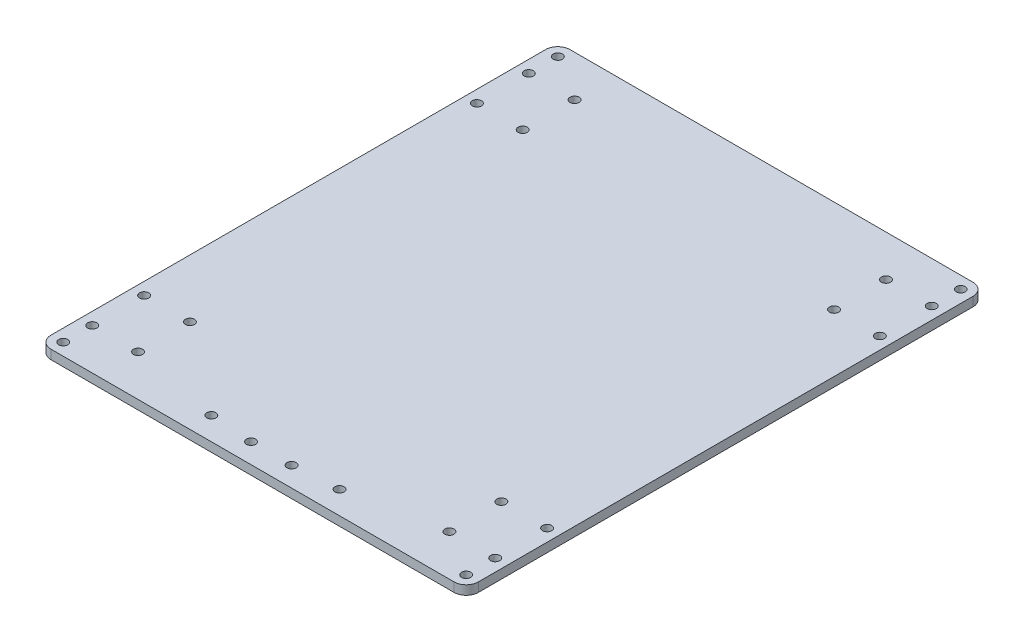
ISO-10303-21;
HEADER;
FILE_DESCRIPTION(('STEP AP214'),'2;1');
FILE_NAME('part.step','',(''),(''),'','','');
FILE_SCHEMA(('AUTOMOTIVE_DESIGN { 1 0 10303 214 1 1 1 1 }'));
ENDSEC;
DATA;
#1=APPLICATION_CONTEXT('core data for automotive mechanical design processes');
#2=APPLICATION_PROTOCOL_DEFINITION('international standard','automotive_design',2000,#1);
#3=PRODUCT_CONTEXT('',#1,'mechanical');
#4=PRODUCT('Part','Part','',(#3));
#5=PRODUCT_RELATED_PRODUCT_CATEGORY('part','',(#4));
#6=PRODUCT_DEFINITION_FORMATION('','',#4);
#7=PRODUCT_DEFINITION_CONTEXT('part definition',#1,'design');
#8=PRODUCT_DEFINITION('design','',#6,#7);
#9=PRODUCT_DEFINITION_SHAPE('','',#8);
#10=(LENGTH_UNIT() NAMED_UNIT(*) SI_UNIT(.MILLI.,.METRE.));
#11=(NAMED_UNIT(*) PLANE_ANGLE_UNIT() SI_UNIT($,.RADIAN.));
#12=(NAMED_UNIT(*) SI_UNIT($,.STERADIAN.) SOLID_ANGLE_UNIT());
#13=UNCERTAINTY_MEASURE_WITH_UNIT(LENGTH_MEASURE(1.E-05),#10,'distance_accuracy_value','');
#14=(GEOMETRIC_REPRESENTATION_CONTEXT(3) GLOBAL_UNCERTAINTY_ASSIGNED_CONTEXT((#13)) GLOBAL_UNIT_ASSIGNED_CONTEXT((#10,
#11,#12)) REPRESENTATION_CONTEXT('',''));
#15=CARTESIAN_POINT('',(0.,0.,0.));
#16=DIRECTION('',(0.,0.,1.));
#17=DIRECTION('',(1.,0.,0.));
#18=AXIS2_PLACEMENT_3D('',#15,#16,#17);
#19=CARTESIAN_POINT('',(-136.,3.,-3.99999999999998));
#20=DIRECTION('',(0.,-1.,0.));
#21=DIRECTION('',(0.,0.,-1.));
#22=AXIS2_PLACEMENT_3D('',#19,#20,#21);
#23=PLANE('',#22);
#24=CARTESIAN_POINT('',(-136.,3.,-3.99999999999998));
#25=DIRECTION('',(0.,1.,0.));
#26=DIRECTION('',(0.,0.,-1.));
#27=AXIS2_PLACEMENT_3D('',#24,#25,#26);
#28=CIRCLE('',#27,4.);
#29=CARTESIAN_POINT('',(-140.,3.,-3.99999999999998));
#30=VERTEX_POINT('',#29);
#31=CARTESIAN_POINT('',(-136.,3.,0.));
#32=VERTEX_POINT('',#31);
#33=EDGE_CURVE('E147',#30,#32,#28,.T.);
#34=ORIENTED_EDGE('',*,*,#33,.T.);
#35=DIRECTION('',(1.,0.,0.));
#36=VECTOR('',#35,1.);
#37=CARTESIAN_POINT('',(-3.99999999999998,3.,0.));
#38=LINE('',#37,#36);
#39=CARTESIAN_POINT('',(-3.99999999999998,3.,0.));
#40=VERTEX_POINT('',#39);
#41=EDGE_CURVE('E95',#32,#40,#38,.T.);
#42=ORIENTED_EDGE('',*,*,#41,.T.);
#43=CARTESIAN_POINT('',(-4.,3.,-4.));
#44=DIRECTION('',(0.,1.,0.));
#45=DIRECTION('',(0.,0.,1.));
#46=AXIS2_PLACEMENT_3D('',#43,#44,#45);
#47=CIRCLE('',#46,4.00000000000001);
#48=CARTESIAN_POINT('',(0.,3.,-4.));
#49=VERTEX_POINT('',#48);
#50=EDGE_CURVE('E162',#40,#49,#47,.T.);
#51=ORIENTED_EDGE('',*,*,#50,.T.);
#52=DIRECTION('',(0.,0.,-1.));
#53=VECTOR('',#52,1.);
#54=CARTESIAN_POINT('',(0.,3.,-166.));
#55=LINE('',#54,#53);
#56=CARTESIAN_POINT('',(0.,3.,-166.));
#57=VERTEX_POINT('',#56);
#58=EDGE_CURVE('E175',#49,#57,#55,.T.);
#59=ORIENTED_EDGE('',*,*,#58,.T.);
#60=CARTESIAN_POINT('',(-4.,3.,-166.));
#61=DIRECTION('',(0.,1.,0.));
#62=DIRECTION('',(0.,0.,-1.));
#63=AXIS2_PLACEMENT_3D('',#60,#61,#62);
#64=CIRCLE('',#63,4.);
#65=CARTESIAN_POINT('',(-4.,3.,-170.));
#66=VERTEX_POINT('',#65);
#67=EDGE_CURVE('E114',#57,#66,#64,.T.);
#68=ORIENTED_EDGE('',*,*,#67,.T.);
#69=DIRECTION('',(-1.,0.,0.));
#70=VECTOR('',#69,1.);
#71=CARTESIAN_POINT('',(-136.,3.,-170.));
#72=LINE('',#71,#70);
#73=CARTESIAN_POINT('',(-136.,3.,-170.));
#74=VERTEX_POINT('',#73);
#75=EDGE_CURVE('E108',#66,#74,#72,.T.);
#76=ORIENTED_EDGE('',*,*,#75,.T.);
#77=CARTESIAN_POINT('',(-136.,3.,-166.));
#78=DIRECTION('',(0.,1.,0.));
#79=DIRECTION('',(0.,0.,-1.));
#80=AXIS2_PLACEMENT_3D('',#77,#78,#79);
#81=CIRCLE('',#80,3.99999999999999);
#82=CARTESIAN_POINT('',(-140.,3.,-166.));
#83=VERTEX_POINT('',#82);
#84=EDGE_CURVE('E112',#74,#83,#81,.T.);
#85=ORIENTED_EDGE('',*,*,#84,.T.);
#86=DIRECTION('',(0.,0.,1.));
#87=VECTOR('',#86,1.);
#88=CARTESIAN_POINT('',(-140.,3.,-3.99999999999998));
#89=LINE('',#88,#87);
#90=EDGE_CURVE('E52',#83,#30,#89,.T.);
#91=ORIENTED_EDGE('',*,*,#90,.T.);
#92=EDGE_LOOP('',(#34,#42,#51,#59,#68,#76,#85,#91));
#93=FACE_BOUND('',#92,.T.);
#94=CARTESIAN_POINT('',(-136.,3.,-166.));
#95=DIRECTION('',(0.,1.,0.));
#96=DIRECTION('',(0.,0.,1.));
#97=AXIS2_PLACEMENT_3D('',#94,#95,#96);
#98=CIRCLE('',#97,1.5);
#99=CARTESIAN_POINT('',(-136.,3.,-164.5));
#100=VERTEX_POINT('',#99);
#101=EDGE_CURVE('E136',#100,#100,#98,.T.);
#102=ORIENTED_EDGE('',*,*,#101,.F.);
#103=EDGE_LOOP('',(#102));
#104=FACE_BOUND('',#103,.T.);
#105=CARTESIAN_POINT('',(-4.,3.,-166.));
#106=DIRECTION('',(0.,1.,0.));
#107=DIRECTION('',(0.,0.,1.));
#108=AXIS2_PLACEMENT_3D('',#105,#106,#107);
#109=CIRCLE('',#108,1.5);
#110=CARTESIAN_POINT('',(-4.,3.,-164.5));
#111=VERTEX_POINT('',#110);
#112=EDGE_CURVE('E184',#111,#111,#109,.T.);
#113=ORIENTED_EDGE('',*,*,#112,.F.);
#114=EDGE_LOOP('',(#113));
#115=FACE_BOUND('',#114,.T.);
#116=CARTESIAN_POINT('',(-136.,3.,-3.99999999999998));
#117=DIRECTION('',(0.,1.,0.));
#118=DIRECTION('',(0.,0.,1.));
#119=AXIS2_PLACEMENT_3D('',#116,#117,#118);
#120=CIRCLE('',#119,1.5);
#121=CARTESIAN_POINT('',(-136.,3.,-2.49999999999999));
#122=VERTEX_POINT('',#121);
#123=EDGE_CURVE('E190',#122,#122,#120,.T.);
#124=ORIENTED_EDGE('',*,*,#123,.F.);
#125=EDGE_LOOP('',(#124));
#126=FACE_BOUND('',#125,.T.);
#127=CARTESIAN_POINT('',(-4.,3.,-4.));
#128=DIRECTION('',(0.,1.,0.));
#129=DIRECTION('',(0.,0.,1.));
#130=AXIS2_PLACEMENT_3D('',#127,#128,#129);
#131=CIRCLE('',#130,1.5);
#132=CARTESIAN_POINT('',(-4.,3.,-2.5));
#133=VERTEX_POINT('',#132);
#134=EDGE_CURVE('E196',#133,#133,#131,.T.);
#135=ORIENTED_EDGE('',*,*,#134,.F.);
#136=EDGE_LOOP('',(#135));
#137=FACE_BOUND('',#136,.T.);
#138=CARTESIAN_POINT('',(-121.,3.,-156.5));
#139=DIRECTION('',(0.,1.,0.));
#140=DIRECTION('',(0.,0.,1.));
#141=AXIS2_PLACEMENT_3D('',#138,#139,#140);
#142=CIRCLE('',#141,1.5);
#143=CARTESIAN_POINT('',(-121.,3.,-155.));
#144=VERTEX_POINT('',#143);
#145=EDGE_CURVE('E202',#144,#144,#142,.T.);
#146=ORIENTED_EDGE('',*,*,#145,.F.);
#147=EDGE_LOOP('',(#146));
#148=FACE_BOUND('',#147,.T.);
#149=CARTESIAN_POINT('',(-136.,3.,-156.5));
#150=DIRECTION('',(0.,1.,0.));
#151=DIRECTION('',(0.,0.,1.));
#152=AXIS2_PLACEMENT_3D('',#149,#150,#151);
#153=CIRCLE('',#152,1.5);
#154=CARTESIAN_POINT('',(-136.,3.,-155.));
#155=VERTEX_POINT('',#154);
#156=EDGE_CURVE('E208',#155,#155,#153,.T.);
#157=ORIENTED_EDGE('',*,*,#156,.F.);
#158=EDGE_LOOP('',(#157));
#159=FACE_BOUND('',#158,.T.);
#160=CARTESIAN_POINT('',(-136.,3.,-139.5));
#161=DIRECTION('',(0.,1.,0.));
#162=DIRECTION('',(0.,0.,1.));
#163=AXIS2_PLACEMENT_3D('',#160,#161,#162);
#164=CIRCLE('',#163,1.5);
#165=CARTESIAN_POINT('',(-136.,3.,-138.));
#166=VERTEX_POINT('',#165);
#167=EDGE_CURVE('E214',#166,#166,#164,.T.);
#168=ORIENTED_EDGE('',*,*,#167,.F.);
#169=EDGE_LOOP('',(#168));
#170=FACE_BOUND('',#169,.T.);
#171=CARTESIAN_POINT('',(-121.,3.,-139.5));
#172=DIRECTION('',(0.,1.,0.));
#173=DIRECTION('',(0.,0.,1.));
#174=AXIS2_PLACEMENT_3D('',#171,#172,#173);
#175=CIRCLE('',#174,1.5);
#176=CARTESIAN_POINT('',(-121.,3.,-138.));
#177=VERTEX_POINT('',#176);
#178=EDGE_CURVE('E220',#177,#177,#175,.T.);
#179=ORIENTED_EDGE('',*,*,#178,.F.);
#180=EDGE_LOOP('',(#179));
#181=FACE_BOUND('',#180,.T.);
#182=CARTESIAN_POINT('',(-19.,3.,-156.5));
#183=DIRECTION('',(0.,1.,0.));
#184=DIRECTION('',(0.,0.,1.));
#185=AXIS2_PLACEMENT_3D('',#182,#183,#184);
#186=CIRCLE('',#185,1.49999999999999);
#187=CARTESIAN_POINT('',(-19.,3.,-155.));
#188=VERTEX_POINT('',#187);
#189=EDGE_CURVE('E226',#188,#188,#186,.T.);
#190=ORIENTED_EDGE('',*,*,#189,.F.);
#191=EDGE_LOOP('',(#190));
#192=FACE_BOUND('',#191,.T.);
#193=CARTESIAN_POINT('',(-3.99999999999998,3.,-156.5));
#194=DIRECTION('',(0.,1.,0.));
#195=DIRECTION('',(0.,0.,1.));
#196=AXIS2_PLACEMENT_3D('',#193,#194,#195);
#197=CIRCLE('',#196,1.5);
#198=CARTESIAN_POINT('',(-3.99999999999998,3.,-155.));
#199=VERTEX_POINT('',#198);
#200=EDGE_CURVE('E232',#199,#199,#197,.T.);
#201=ORIENTED_EDGE('',*,*,#200,.F.);
#202=EDGE_LOOP('',(#201));
#203=FACE_BOUND('',#202,.T.);
#204=CARTESIAN_POINT('',(-3.99999999999999,3.,-139.5));
#205=DIRECTION('',(0.,1.,0.));
#206=DIRECTION('',(0.,0.,1.));
#207=AXIS2_PLACEMENT_3D('',#204,#205,#206);
#208=CIRCLE('',#207,1.5);
#209=CARTESIAN_POINT('',(-3.99999999999999,3.,-138.));
#210=VERTEX_POINT('',#209);
#211=EDGE_CURVE('E238',#210,#210,#208,.T.);
#212=ORIENTED_EDGE('',*,*,#211,.F.);
#213=EDGE_LOOP('',(#212));
#214=FACE_BOUND('',#213,.T.);
#215=CARTESIAN_POINT('',(-19.,3.,-139.5));
#216=DIRECTION('',(0.,1.,0.));
#217=DIRECTION('',(0.,0.,1.));
#218=AXIS2_PLACEMENT_3D('',#215,#216,#217);
#219=CIRCLE('',#218,1.50000000000002);
#220=CARTESIAN_POINT('',(-19.,3.,-138.));
#221=VERTEX_POINT('',#220);
#222=EDGE_CURVE('E244',#221,#221,#219,.T.);
#223=ORIENTED_EDGE('',*,*,#222,.F.);
#224=EDGE_LOOP('',(#223));
#225=FACE_BOUND('',#224,.T.);
#226=CARTESIAN_POINT('',(-63.6906513248161,3.,-6.49999999999999));
#227=DIRECTION('',(0.,1.,0.));
#228=DIRECTION('',(0.,0.,1.));
#229=AXIS2_PLACEMENT_3D('',#226,#227,#228);
#230=CIRCLE('',#229,1.5);
#231=CARTESIAN_POINT('',(-63.6906513248161,3.,-4.99999999999999));
#232=VERTEX_POINT('',#231);
#233=EDGE_CURVE('E250',#232,#232,#230,.T.);
#234=ORIENTED_EDGE('',*,*,#233,.F.);
#235=EDGE_LOOP('',(#234));
#236=FACE_BOUND('',#235,.T.);
#237=CARTESIAN_POINT('',(-77.,3.,-6.49999999999999));
#238=DIRECTION('',(0.,1.,0.));
#239=DIRECTION('',(0.,0.,1.));
#240=AXIS2_PLACEMENT_3D('',#237,#238,#239);
#241=CIRCLE('',#240,1.5);
#242=CARTESIAN_POINT('',(-77.,3.,-4.99999999999999));
#243=VERTEX_POINT('',#242);
#244=EDGE_CURVE('E256',#243,#243,#241,.T.);
#245=ORIENTED_EDGE('',*,*,#244,.F.);
#246=EDGE_LOOP('',(#245));
#247=FACE_BOUND('',#246,.T.);
#248=CARTESIAN_POINT('',(-121.,3.,-30.5));
#249=DIRECTION('',(0.,1.,0.));
#250=DIRECTION('',(0.,0.,1.));
#251=AXIS2_PLACEMENT_3D('',#248,#249,#250);
#252=CIRCLE('',#251,1.5);
#253=CARTESIAN_POINT('',(-121.,3.,-29.));
#254=VERTEX_POINT('',#253);
#255=EDGE_CURVE('E262',#254,#254,#252,.T.);
#256=ORIENTED_EDGE('',*,*,#255,.F.);
#257=EDGE_LOOP('',(#256));
#258=FACE_BOUND('',#257,.T.);
#259=CARTESIAN_POINT('',(-136.,3.,-30.5));
#260=DIRECTION('',(0.,1.,0.));
#261=DIRECTION('',(0.,0.,1.));
#262=AXIS2_PLACEMENT_3D('',#259,#260,#261);
#263=CIRCLE('',#262,1.5);
#264=CARTESIAN_POINT('',(-136.,3.,-29.));
#265=VERTEX_POINT('',#264);
#266=EDGE_CURVE('E268',#265,#265,#263,.T.);
#267=ORIENTED_EDGE('',*,*,#266,.F.);
#268=EDGE_LOOP('',(#267));
#269=FACE_BOUND('',#268,.T.);
#270=CARTESIAN_POINT('',(-136.,3.,-13.5));
#271=DIRECTION('',(0.,1.,0.));
#272=DIRECTION('',(0.,0.,1.));
#273=AXIS2_PLACEMENT_3D('',#270,#271,#272);
#274=CIRCLE('',#273,1.5);
#275=CARTESIAN_POINT('',(-136.,3.,-12.));
#276=VERTEX_POINT('',#275);
#277=EDGE_CURVE('E274',#276,#276,#274,.T.);
#278=ORIENTED_EDGE('',*,*,#277,.F.);
#279=EDGE_LOOP('',(#278));
#280=FACE_BOUND('',#279,.T.);
#281=CARTESIAN_POINT('',(-121.,3.,-13.5));
#282=DIRECTION('',(0.,1.,0.));
#283=DIRECTION('',(0.,0.,1.));
#284=AXIS2_PLACEMENT_3D('',#281,#282,#283);
#285=CIRCLE('',#284,1.5);
#286=CARTESIAN_POINT('',(-121.,3.,-12.));
#287=VERTEX_POINT('',#286);
#288=EDGE_CURVE('E280',#287,#287,#285,.T.);
#289=ORIENTED_EDGE('',*,*,#288,.F.);
#290=EDGE_LOOP('',(#289));
#291=FACE_BOUND('',#290,.T.);
#292=CARTESIAN_POINT('',(-18.9999999999996,3.,-30.5000000000001));
#293=DIRECTION('',(0.,1.,0.));
#294=DIRECTION('',(0.,0.,1.));
#295=AXIS2_PLACEMENT_3D('',#292,#293,#294);
#296=CIRCLE('',#295,1.5);
#297=CARTESIAN_POINT('',(-18.9999999999996,3.,-29.0000000000001));
#298=VERTEX_POINT('',#297);
#299=EDGE_CURVE('E286',#298,#298,#296,.T.);
#300=ORIENTED_EDGE('',*,*,#299,.F.);
#301=EDGE_LOOP('',(#300));
#302=FACE_BOUND('',#301,.T.);
#303=CARTESIAN_POINT('',(-3.99999999999955,3.,-30.5000000000002));
#304=DIRECTION('',(0.,1.,0.));
#305=DIRECTION('',(0.,0.,1.));
#306=AXIS2_PLACEMENT_3D('',#303,#304,#305);
#307=CIRCLE('',#306,1.5);
#308=CARTESIAN_POINT('',(-3.99999999999955,3.,-29.0000000000002));
#309=VERTEX_POINT('',#308);
#310=EDGE_CURVE('E292',#309,#309,#307,.T.);
#311=ORIENTED_EDGE('',*,*,#310,.F.);
#312=EDGE_LOOP('',(#311));
#313=FACE_BOUND('',#312,.T.);
#314=CARTESIAN_POINT('',(-18.9999999999994,3.,-13.5000000000001));
#315=DIRECTION('',(0.,1.,0.));
#316=DIRECTION('',(0.,0.,1.));
#317=AXIS2_PLACEMENT_3D('',#314,#315,#316);
#318=CIRCLE('',#317,1.50000000000001);
#319=CARTESIAN_POINT('',(-18.9999999999994,3.,-12.0000000000001));
#320=VERTEX_POINT('',#319);
#321=EDGE_CURVE('E298',#320,#320,#318,.T.);
#322=ORIENTED_EDGE('',*,*,#321,.F.);
#323=EDGE_LOOP('',(#322));
#324=FACE_BOUND('',#323,.T.);
#325=CARTESIAN_POINT('',(-3.99999999999945,3.,-13.5000000000002));
#326=DIRECTION('',(0.,1.,0.));
#327=DIRECTION('',(0.,0.,1.));
#328=AXIS2_PLACEMENT_3D('',#325,#326,#327);
#329=CIRCLE('',#328,1.50000000000001);
#330=CARTESIAN_POINT('',(-3.99999999999945,3.,-12.0000000000002));
#331=VERTEX_POINT('',#330);
#332=EDGE_CURVE('E304',#331,#331,#329,.T.);
#333=ORIENTED_EDGE('',*,*,#332,.F.);
#334=EDGE_LOOP('',(#333));
#335=FACE_BOUND('',#334,.T.);
#336=CARTESIAN_POINT('',(-91.0000000000013,3.,-7.50000000000098));
#337=DIRECTION('',(0.,1.,0.));
#338=DIRECTION('',(0.,0.,1.));
#339=AXIS2_PLACEMENT_3D('',#336,#337,#338);
#340=CIRCLE('',#339,1.5);
#341=CARTESIAN_POINT('',(-91.0000000000013,3.,-6.00000000000098));
#342=VERTEX_POINT('',#341);
#343=EDGE_CURVE('E310',#342,#342,#340,.T.);
#344=ORIENTED_EDGE('',*,*,#343,.F.);
#345=EDGE_LOOP('',(#344));
#346=FACE_BOUND('',#345,.T.);
#347=CARTESIAN_POINT('',(-49.0000000000013,3.,-7.50000000000038));
#348=DIRECTION('',(0.,1.,0.));
#349=DIRECTION('',(0.,0.,1.));
#350=AXIS2_PLACEMENT_3D('',#347,#348,#349);
#351=CIRCLE('',#350,1.5);
#352=CARTESIAN_POINT('',(-49.0000000000013,3.,-6.00000000000039));
#353=VERTEX_POINT('',#352);
#354=EDGE_CURVE('E316',#353,#353,#351,.T.);
#355=ORIENTED_EDGE('',*,*,#354,.F.);
#356=EDGE_LOOP('',(#355));
#357=FACE_BOUND('',#356,.T.);
#358=ADVANCED_FACE('F35',(#93,#104,#115,#126,#137,#148,#159,#170,#181,#192,#203,#214,#225,#236,
#247,#258,#269,#280,#291,#302,#313,#324,#335,#346,#357),#23,.F.);
#359=CARTESIAN_POINT('',(-136.,0.,-3.99999999999998));
#360=DIRECTION('',(0.,-1.,0.));
#361=DIRECTION('',(0.,0.,-1.));
#362=AXIS2_PLACEMENT_3D('',#359,#360,#361);
#363=PLANE('',#362);
#364=CARTESIAN_POINT('',(-91.0000000000013,0.,-7.50000000000098));
#365=DIRECTION('',(0.,1.,0.));
#366=DIRECTION('',(0.,0.,1.));
#367=AXIS2_PLACEMENT_3D('',#364,#365,#366);
#368=CIRCLE('',#367,1.5);
#369=CARTESIAN_POINT('',(-91.0000000000013,0.,-6.00000000000098));
#370=VERTEX_POINT('',#369);
#371=EDGE_CURVE('E313',#370,#370,#368,.T.);
#372=ORIENTED_EDGE('',*,*,#371,.T.);
#373=EDGE_LOOP('',(#372));
#374=FACE_BOUND('',#373,.T.);
#375=CARTESIAN_POINT('',(-18.9999999999994,0.,-13.5000000000001));
#376=DIRECTION('',(0.,1.,0.));
#377=DIRECTION('',(0.,0.,1.));
#378=AXIS2_PLACEMENT_3D('',#375,#376,#377);
#379=CIRCLE('',#378,1.50000000000001);
#380=CARTESIAN_POINT('',(-18.9999999999994,0.,-12.0000000000001));
#381=VERTEX_POINT('',#380);
#382=EDGE_CURVE('E301',#381,#381,#379,.T.);
#383=ORIENTED_EDGE('',*,*,#382,.T.);
#384=EDGE_LOOP('',(#383));
#385=FACE_BOUND('',#384,.T.);
#386=CARTESIAN_POINT('',(-18.9999999999996,0.,-30.5000000000001));
#387=DIRECTION('',(0.,1.,0.));
#388=DIRECTION('',(0.,0.,1.));
#389=AXIS2_PLACEMENT_3D('',#386,#387,#388);
#390=CIRCLE('',#389,1.5);
#391=CARTESIAN_POINT('',(-18.9999999999996,0.,-29.0000000000001));
#392=VERTEX_POINT('',#391);
#393=EDGE_CURVE('E289',#392,#392,#390,.T.);
#394=ORIENTED_EDGE('',*,*,#393,.T.);
#395=EDGE_LOOP('',(#394));
#396=FACE_BOUND('',#395,.T.);
#397=CARTESIAN_POINT('',(-136.,0.,-13.5));
#398=DIRECTION('',(0.,1.,0.));
#399=DIRECTION('',(0.,0.,1.));
#400=AXIS2_PLACEMENT_3D('',#397,#398,#399);
#401=CIRCLE('',#400,1.5);
#402=CARTESIAN_POINT('',(-136.,0.,-12.));
#403=VERTEX_POINT('',#402);
#404=EDGE_CURVE('E277',#403,#403,#401,.T.);
#405=ORIENTED_EDGE('',*,*,#404,.T.);
#406=EDGE_LOOP('',(#405));
#407=FACE_BOUND('',#406,.T.);
#408=CARTESIAN_POINT('',(-121.,0.,-30.5));
#409=DIRECTION('',(0.,1.,0.));
#410=DIRECTION('',(0.,0.,1.));
#411=AXIS2_PLACEMENT_3D('',#408,#409,#410);
#412=CIRCLE('',#411,1.5);
#413=CARTESIAN_POINT('',(-121.,0.,-29.));
#414=VERTEX_POINT('',#413);
#415=EDGE_CURVE('E265',#414,#414,#412,.T.);
#416=ORIENTED_EDGE('',*,*,#415,.T.);
#417=EDGE_LOOP('',(#416));
#418=FACE_BOUND('',#417,.T.);
#419=CARTESIAN_POINT('',(-63.6906513248161,0.,-6.49999999999999));
#420=DIRECTION('',(0.,1.,0.));
#421=DIRECTION('',(0.,0.,1.));
#422=AXIS2_PLACEMENT_3D('',#419,#420,#421);
#423=CIRCLE('',#422,1.5);
#424=CARTESIAN_POINT('',(-63.6906513248161,0.,-4.99999999999999));
#425=VERTEX_POINT('',#424);
#426=EDGE_CURVE('E253',#425,#425,#423,.T.);
#427=ORIENTED_EDGE('',*,*,#426,.T.);
#428=EDGE_LOOP('',(#427));
#429=FACE_BOUND('',#428,.T.);
#430=CARTESIAN_POINT('',(-3.99999999999999,0.,-139.5));
#431=DIRECTION('',(0.,1.,0.));
#432=DIRECTION('',(0.,0.,1.));
#433=AXIS2_PLACEMENT_3D('',#430,#431,#432);
#434=CIRCLE('',#433,1.5);
#435=CARTESIAN_POINT('',(-3.99999999999999,0.,-138.));
#436=VERTEX_POINT('',#435);
#437=EDGE_CURVE('E241',#436,#436,#434,.T.);
#438=ORIENTED_EDGE('',*,*,#437,.T.);
#439=EDGE_LOOP('',(#438));
#440=FACE_BOUND('',#439,.T.);
#441=CARTESIAN_POINT('',(-19.,0.,-156.5));
#442=DIRECTION('',(0.,1.,0.));
#443=DIRECTION('',(0.,0.,1.));
#444=AXIS2_PLACEMENT_3D('',#441,#442,#443);
#445=CIRCLE('',#444,1.49999999999999);
#446=CARTESIAN_POINT('',(-19.,0.,-155.));
#447=VERTEX_POINT('',#446);
#448=EDGE_CURVE('E229',#447,#447,#445,.T.);
#449=ORIENTED_EDGE('',*,*,#448,.T.);
#450=EDGE_LOOP('',(#449));
#451=FACE_BOUND('',#450,.T.);
#452=CARTESIAN_POINT('',(-136.,0.,-139.5));
#453=DIRECTION('',(0.,1.,0.));
#454=DIRECTION('',(0.,0.,1.));
#455=AXIS2_PLACEMENT_3D('',#452,#453,#454);
#456=CIRCLE('',#455,1.5);
#457=CARTESIAN_POINT('',(-136.,0.,-138.));
#458=VERTEX_POINT('',#457);
#459=EDGE_CURVE('E217',#458,#458,#456,.T.);
#460=ORIENTED_EDGE('',*,*,#459,.T.);
#461=EDGE_LOOP('',(#460));
#462=FACE_BOUND('',#461,.T.);
#463=CARTESIAN_POINT('',(-121.,0.,-156.5));
#464=DIRECTION('',(0.,1.,0.));
#465=DIRECTION('',(0.,0.,1.));
#466=AXIS2_PLACEMENT_3D('',#463,#464,#465);
#467=CIRCLE('',#466,1.5);
#468=CARTESIAN_POINT('',(-121.,0.,-155.));
#469=VERTEX_POINT('',#468);
#470=EDGE_CURVE('E205',#469,#469,#467,.T.);
#471=ORIENTED_EDGE('',*,*,#470,.T.);
#472=EDGE_LOOP('',(#471));
#473=FACE_BOUND('',#472,.T.);
#474=CARTESIAN_POINT('',(-136.,0.,-3.99999999999998));
#475=DIRECTION('',(0.,1.,0.));
#476=DIRECTION('',(0.,0.,1.));
#477=AXIS2_PLACEMENT_3D('',#474,#475,#476);
#478=CIRCLE('',#477,1.5);
#479=CARTESIAN_POINT('',(-136.,0.,-2.49999999999999));
#480=VERTEX_POINT('',#479);
#481=EDGE_CURVE('E193',#480,#480,#478,.T.);
#482=ORIENTED_EDGE('',*,*,#481,.T.);
#483=EDGE_LOOP('',(#482));
#484=FACE_BOUND('',#483,.T.);
#485=CARTESIAN_POINT('',(-136.,0.,-166.));
#486=DIRECTION('',(0.,1.,0.));
#487=DIRECTION('',(0.,0.,1.));
#488=AXIS2_PLACEMENT_3D('',#485,#486,#487);
#489=CIRCLE('',#488,1.5);
#490=CARTESIAN_POINT('',(-136.,0.,-164.5));
#491=VERTEX_POINT('',#490);
#492=EDGE_CURVE('E181',#491,#491,#489,.T.);
#493=ORIENTED_EDGE('',*,*,#492,.T.);
#494=EDGE_LOOP('',(#493));
#495=FACE_BOUND('',#494,.T.);
#496=CARTESIAN_POINT('',(-136.,0.,-3.99999999999998));
#497=DIRECTION('',(0.,1.,0.));
#498=DIRECTION('',(0.,0.,-1.));
#499=AXIS2_PLACEMENT_3D('',#496,#497,#498);
#500=CIRCLE('',#499,4.);
#501=CARTESIAN_POINT('',(-140.,0.,-3.99999999999998));
#502=VERTEX_POINT('',#501);
#503=CARTESIAN_POINT('',(-136.,0.,0.));
#504=VERTEX_POINT('',#503);
#505=EDGE_CURVE('E132',#502,#504,#500,.T.);
#506=ORIENTED_EDGE('',*,*,#505,.F.);
#507=DIRECTION('',(0.,0.,1.));
#508=VECTOR('',#507,1.);
#509=CARTESIAN_POINT('',(-140.,0.,-3.99999999999998));
#510=LINE('',#509,#508);
#511=CARTESIAN_POINT('',(-140.,0.,-166.));
#512=VERTEX_POINT('',#511);
#513=EDGE_CURVE('E87',#512,#502,#510,.T.);
#514=ORIENTED_EDGE('',*,*,#513,.F.);
#515=CARTESIAN_POINT('',(-136.,0.,-166.));
#516=DIRECTION('',(0.,1.,0.));
#517=DIRECTION('',(0.,0.,-1.));
#518=AXIS2_PLACEMENT_3D('',#515,#516,#517);
#519=CIRCLE('',#518,3.99999999999999);
#520=CARTESIAN_POINT('',(-136.,0.,-170.));
#521=VERTEX_POINT('',#520);
#522=EDGE_CURVE('E81',#521,#512,#519,.T.);
#523=ORIENTED_EDGE('',*,*,#522,.F.);
#524=DIRECTION('',(-1.,0.,0.));
#525=VECTOR('',#524,1.);
#526=CARTESIAN_POINT('',(-136.,0.,-170.));
#527=LINE('',#526,#525);
#528=CARTESIAN_POINT('',(-4.,0.,-170.));
#529=VERTEX_POINT('',#528);
#530=EDGE_CURVE('E122',#529,#521,#527,.T.);
#531=ORIENTED_EDGE('',*,*,#530,.F.);
#532=CARTESIAN_POINT('',(-4.,0.,-166.));
#533=DIRECTION('',(0.,1.,0.));
#534=DIRECTION('',(0.,0.,-1.));
#535=AXIS2_PLACEMENT_3D('',#532,#533,#534);
#536=CIRCLE('',#535,4.);
#537=CARTESIAN_POINT('',(0.,0.,-166.));
#538=VERTEX_POINT('',#537);
#539=EDGE_CURVE('E142',#538,#529,#536,.T.);
#540=ORIENTED_EDGE('',*,*,#539,.F.);
#541=DIRECTION('',(0.,0.,-1.));
#542=VECTOR('',#541,1.);
#543=CARTESIAN_POINT('',(0.,0.,-166.));
#544=LINE('',#543,#542);
#545=CARTESIAN_POINT('',(0.,0.,-4.));
#546=VERTEX_POINT('',#545);
#547=EDGE_CURVE('E140',#546,#538,#544,.T.);
#548=ORIENTED_EDGE('',*,*,#547,.F.);
#549=CARTESIAN_POINT('',(-4.,0.,-4.));
#550=DIRECTION('',(0.,1.,0.));
#551=DIRECTION('',(0.,0.,1.));
#552=AXIS2_PLACEMENT_3D('',#549,#550,#551);
#553=CIRCLE('',#552,4.00000000000001);
#554=CARTESIAN_POINT('',(-3.99999999999998,0.,0.));
#555=VERTEX_POINT('',#554);
#556=EDGE_CURVE('E138',#555,#546,#553,.T.);
#557=ORIENTED_EDGE('',*,*,#556,.F.);
#558=DIRECTION('',(1.,0.,0.));
#559=VECTOR('',#558,1.);
#560=CARTESIAN_POINT('',(-3.99999999999998,0.,0.));
#561=LINE('',#560,#559);
#562=EDGE_CURVE('E135',#504,#555,#561,.T.);
#563=ORIENTED_EDGE('',*,*,#562,.F.);
#564=EDGE_LOOP('',(#506,#514,#523,#531,#540,#548,#557,#563));
#565=FACE_BOUND('',#564,.T.);
#566=CARTESIAN_POINT('',(-4.,0.,-166.));
#567=DIRECTION('',(0.,1.,0.));
#568=DIRECTION('',(0.,0.,1.));
#569=AXIS2_PLACEMENT_3D('',#566,#567,#568);
#570=CIRCLE('',#569,1.5);
#571=CARTESIAN_POINT('',(-4.,0.,-164.5));
#572=VERTEX_POINT('',#571);
#573=EDGE_CURVE('E187',#572,#572,#570,.T.);
#574=ORIENTED_EDGE('',*,*,#573,.T.);
#575=EDGE_LOOP('',(#574));
#576=FACE_BOUND('',#575,.T.);
#577=CARTESIAN_POINT('',(-4.,0.,-4.));
#578=DIRECTION('',(0.,1.,0.));
#579=DIRECTION('',(0.,0.,1.));
#580=AXIS2_PLACEMENT_3D('',#577,#578,#579);
#581=CIRCLE('',#580,1.5);
#582=CARTESIAN_POINT('',(-4.,0.,-2.5));
#583=VERTEX_POINT('',#582);
#584=EDGE_CURVE('E199',#583,#583,#581,.T.);
#585=ORIENTED_EDGE('',*,*,#584,.T.);
#586=EDGE_LOOP('',(#585));
#587=FACE_BOUND('',#586,.T.);
#588=CARTESIAN_POINT('',(-136.,0.,-156.5));
#589=DIRECTION('',(0.,1.,0.));
#590=DIRECTION('',(0.,0.,1.));
#591=AXIS2_PLACEMENT_3D('',#588,#589,#590);
#592=CIRCLE('',#591,1.5);
#593=CARTESIAN_POINT('',(-136.,0.,-155.));
#594=VERTEX_POINT('',#593);
#595=EDGE_CURVE('E211',#594,#594,#592,.T.);
#596=ORIENTED_EDGE('',*,*,#595,.T.);
#597=EDGE_LOOP('',(#596));
#598=FACE_BOUND('',#597,.T.);
#599=CARTESIAN_POINT('',(-121.,0.,-139.5));
#600=DIRECTION('',(0.,1.,0.));
#601=DIRECTION('',(0.,0.,1.));
#602=AXIS2_PLACEMENT_3D('',#599,#600,#601);
#603=CIRCLE('',#602,1.5);
#604=CARTESIAN_POINT('',(-121.,0.,-138.));
#605=VERTEX_POINT('',#604);
#606=EDGE_CURVE('E223',#605,#605,#603,.T.);
#607=ORIENTED_EDGE('',*,*,#606,.T.);
#608=EDGE_LOOP('',(#607));
#609=FACE_BOUND('',#608,.T.);
#610=CARTESIAN_POINT('',(-3.99999999999998,0.,-156.5));
#611=DIRECTION('',(0.,1.,0.));
#612=DIRECTION('',(0.,0.,1.));
#613=AXIS2_PLACEMENT_3D('',#610,#611,#612);
#614=CIRCLE('',#613,1.5);
#615=CARTESIAN_POINT('',(-3.99999999999998,0.,-155.));
#616=VERTEX_POINT('',#615);
#617=EDGE_CURVE('E235',#616,#616,#614,.T.);
#618=ORIENTED_EDGE('',*,*,#617,.T.);
#619=EDGE_LOOP('',(#618));
#620=FACE_BOUND('',#619,.T.);
#621=CARTESIAN_POINT('',(-19.,0.,-139.5));
#622=DIRECTION('',(0.,1.,0.));
#623=DIRECTION('',(0.,0.,1.));
#624=AXIS2_PLACEMENT_3D('',#621,#622,#623);
#625=CIRCLE('',#624,1.50000000000002);
#626=CARTESIAN_POINT('',(-19.,0.,-138.));
#627=VERTEX_POINT('',#626);
#628=EDGE_CURVE('E247',#627,#627,#625,.T.);
#629=ORIENTED_EDGE('',*,*,#628,.T.);
#630=EDGE_LOOP('',(#629));
#631=FACE_BOUND('',#630,.T.);
#632=CARTESIAN_POINT('',(-77.,0.,-6.49999999999999));
#633=DIRECTION('',(0.,1.,0.));
#634=DIRECTION('',(0.,0.,1.));
#635=AXIS2_PLACEMENT_3D('',#632,#633,#634);
#636=CIRCLE('',#635,1.5);
#637=CARTESIAN_POINT('',(-77.,0.,-4.99999999999999));
#638=VERTEX_POINT('',#637);
#639=EDGE_CURVE('E259',#638,#638,#636,.T.);
#640=ORIENTED_EDGE('',*,*,#639,.T.);
#641=EDGE_LOOP('',(#640));
#642=FACE_BOUND('',#641,.T.);
#643=CARTESIAN_POINT('',(-136.,0.,-30.5));
#644=DIRECTION('',(0.,1.,0.));
#645=DIRECTION('',(0.,0.,1.));
#646=AXIS2_PLACEMENT_3D('',#643,#644,#645);
#647=CIRCLE('',#646,1.5);
#648=CARTESIAN_POINT('',(-136.,0.,-29.));
#649=VERTEX_POINT('',#648);
#650=EDGE_CURVE('E271',#649,#649,#647,.T.);
#651=ORIENTED_EDGE('',*,*,#650,.T.);
#652=EDGE_LOOP('',(#651));
#653=FACE_BOUND('',#652,.T.);
#654=CARTESIAN_POINT('',(-121.,0.,-13.5));
#655=DIRECTION('',(0.,1.,0.));
#656=DIRECTION('',(0.,0.,1.));
#657=AXIS2_PLACEMENT_3D('',#654,#655,#656);
#658=CIRCLE('',#657,1.5);
#659=CARTESIAN_POINT('',(-121.,0.,-12.));
#660=VERTEX_POINT('',#659);
#661=EDGE_CURVE('E283',#660,#660,#658,.T.);
#662=ORIENTED_EDGE('',*,*,#661,.T.);
#663=EDGE_LOOP('',(#662));
#664=FACE_BOUND('',#663,.T.);
#665=CARTESIAN_POINT('',(-3.99999999999955,0.,-30.5000000000002));
#666=DIRECTION('',(0.,1.,0.));
#667=DIRECTION('',(0.,0.,1.));
#668=AXIS2_PLACEMENT_3D('',#665,#666,#667);
#669=CIRCLE('',#668,1.5);
#670=CARTESIAN_POINT('',(-3.99999999999955,0.,-29.0000000000002));
#671=VERTEX_POINT('',#670);
#672=EDGE_CURVE('E295',#671,#671,#669,.T.);
#673=ORIENTED_EDGE('',*,*,#672,.T.);
#674=EDGE_LOOP('',(#673));
#675=FACE_BOUND('',#674,.T.);
#676=CARTESIAN_POINT('',(-3.99999999999945,0.,-13.5000000000002));
#677=DIRECTION('',(0.,1.,0.));
#678=DIRECTION('',(0.,0.,1.));
#679=AXIS2_PLACEMENT_3D('',#676,#677,#678);
#680=CIRCLE('',#679,1.50000000000001);
#681=CARTESIAN_POINT('',(-3.99999999999945,0.,-12.0000000000002));
#682=VERTEX_POINT('',#681);
#683=EDGE_CURVE('E307',#682,#682,#680,.T.);
#684=ORIENTED_EDGE('',*,*,#683,.T.);
#685=EDGE_LOOP('',(#684));
#686=FACE_BOUND('',#685,.T.);
#687=CARTESIAN_POINT('',(-49.0000000000013,0.,-7.50000000000038));
#688=DIRECTION('',(0.,1.,0.));
#689=DIRECTION('',(0.,0.,1.));
#690=AXIS2_PLACEMENT_3D('',#687,#688,#689);
#691=CIRCLE('',#690,1.5);
#692=CARTESIAN_POINT('',(-49.0000000000013,0.,-6.00000000000039));
#693=VERTEX_POINT('',#692);
#694=EDGE_CURVE('E319',#693,#693,#691,.T.);
#695=ORIENTED_EDGE('',*,*,#694,.T.);
#696=EDGE_LOOP('',(#695));
#697=FACE_BOUND('',#696,.T.);
#698=ADVANCED_FACE('F166',(#374,#385,#396,#407,#418,#429,#440,#451,#462,#473,#484,#495,#565,
#576,#587,#598,#609,#620,#631,#642,#653,#664,#675,#686,#697),#363,.T.);
#699=CARTESIAN_POINT('',(-136.,3.,-3.99999999999998));
#700=DIRECTION('',(0.,-1.,0.));
#701=DIRECTION('',(0.,0.,-1.));
#702=AXIS2_PLACEMENT_3D('',#699,#700,#701);
#703=CYLINDRICAL_SURFACE('',#702,4.);
#704=ORIENTED_EDGE('',*,*,#505,.T.);
#705=DIRECTION('',(0.,-1.,0.));
#706=VECTOR('',#705,1.);
#707=CARTESIAN_POINT('',(-136.,3.,0.));
#708=LINE('',#707,#706);
#709=EDGE_CURVE('E11',#32,#504,#708,.T.);
#710=ORIENTED_EDGE('',*,*,#709,.F.);
#711=ORIENTED_EDGE('',*,*,#33,.F.);
#712=DIRECTION('',(0.,-1.,0.));
#713=VECTOR('',#712,1.);
#714=CARTESIAN_POINT('',(-140.,3.,-3.99999999999998));
#715=LINE('',#714,#713);
#716=EDGE_CURVE('E128',#30,#502,#715,.T.);
#717=ORIENTED_EDGE('',*,*,#716,.T.);
#718=EDGE_LOOP('',(#704,#710,#711,#717));
#719=FACE_BOUND('',#718,.T.);
#720=ADVANCED_FACE('F37',(#719),#703,.T.);
#721=CARTESIAN_POINT('',(-3.99999999999998,3.,0.));
#722=DIRECTION('',(0.,0.,-1.));
#723=DIRECTION('',(-1.,0.,0.));
#724=AXIS2_PLACEMENT_3D('',#721,#722,#723);
#725=PLANE('',#724);
#726=ORIENTED_EDGE('',*,*,#562,.T.);
#727=DIRECTION('',(0.,-1.,0.));
#728=VECTOR('',#727,1.);
#729=CARTESIAN_POINT('',(-3.99999999999998,3.,0.));
#730=LINE('',#729,#728);
#731=EDGE_CURVE('E44',#40,#555,#730,.T.);
#732=ORIENTED_EDGE('',*,*,#731,.F.);
#733=ORIENTED_EDGE('',*,*,#41,.F.);
#734=ORIENTED_EDGE('',*,*,#709,.T.);
#735=EDGE_LOOP('',(#726,#732,#733,#734));
#736=FACE_BOUND('',#735,.T.);
#737=ADVANCED_FACE('F351',(#736),#725,.F.);
#738=CARTESIAN_POINT('',(-4.,3.,-4.));
#739=DIRECTION('',(0.,-1.,0.));
#740=DIRECTION('',(0.,0.,-1.));
#741=AXIS2_PLACEMENT_3D('',#738,#739,#740);
#742=CYLINDRICAL_SURFACE('',#741,4.00000000000001);
#743=ORIENTED_EDGE('',*,*,#556,.T.);
#744=DIRECTION('',(0.,-1.,0.));
#745=VECTOR('',#744,1.);
#746=CARTESIAN_POINT('',(0.,3.,-4.));
#747=LINE('',#746,#745);
#748=EDGE_CURVE('E154',#49,#546,#747,.T.);
#749=ORIENTED_EDGE('',*,*,#748,.F.);
#750=ORIENTED_EDGE('',*,*,#50,.F.);
#751=ORIENTED_EDGE('',*,*,#731,.T.);
#752=EDGE_LOOP('',(#743,#749,#750,#751));
#753=FACE_BOUND('',#752,.T.);
#754=ADVANCED_FACE('F160',(#753),#742,.T.);
#755=CARTESIAN_POINT('',(0.,3.,-166.));
#756=DIRECTION('',(-1.,0.,0.));
#757=DIRECTION('',(0.,0.,1.));
#758=AXIS2_PLACEMENT_3D('',#755,#756,#757);
#759=PLANE('',#758);
#760=ORIENTED_EDGE('',*,*,#547,.T.);
#761=DIRECTION('',(0.,-1.,0.));
#762=VECTOR('',#761,1.);
#763=CARTESIAN_POINT('',(0.,3.,-166.));
#764=LINE('',#763,#762);
#765=EDGE_CURVE('E151',#57,#538,#764,.T.);
#766=ORIENTED_EDGE('',*,*,#765,.F.);
#767=ORIENTED_EDGE('',*,*,#58,.F.);
#768=ORIENTED_EDGE('',*,*,#748,.T.);
#769=EDGE_LOOP('',(#760,#766,#767,#768));
#770=FACE_BOUND('',#769,.T.);
#771=ADVANCED_FACE('F171',(#770),#759,.F.);
#772=CARTESIAN_POINT('',(-4.,3.,-166.));
#773=DIRECTION('',(0.,-1.,0.));
#774=DIRECTION('',(0.,0.,-1.));
#775=AXIS2_PLACEMENT_3D('',#772,#773,#774);
#776=CYLINDRICAL_SURFACE('',#775,4.);
#777=ORIENTED_EDGE('',*,*,#539,.T.);
#778=DIRECTION('',(0.,-1.,0.));
#779=VECTOR('',#778,1.);
#780=CARTESIAN_POINT('',(-4.,3.,-170.));
#781=LINE('',#780,#779);
#782=EDGE_CURVE('E123',#66,#529,#781,.T.);
#783=ORIENTED_EDGE('',*,*,#782,.F.);
#784=ORIENTED_EDGE('',*,*,#67,.F.);
#785=ORIENTED_EDGE('',*,*,#765,.T.);
#786=EDGE_LOOP('',(#777,#783,#784,#785));
#787=FACE_BOUND('',#786,.T.);
#788=ADVANCED_FACE('F174',(#787),#776,.T.);
#789=CARTESIAN_POINT('',(-136.,3.,-170.));
#790=DIRECTION('',(0.,0.,1.));
#791=DIRECTION('',(1.,0.,0.));
#792=AXIS2_PLACEMENT_3D('',#789,#790,#791);
#793=PLANE('',#792);
#794=ORIENTED_EDGE('',*,*,#530,.T.);
#795=DIRECTION('',(0.,-1.,0.));
#796=VECTOR('',#795,1.);
#797=CARTESIAN_POINT('',(-136.,3.,-170.));
#798=LINE('',#797,#796);
#799=EDGE_CURVE('E119',#74,#521,#798,.T.);
#800=ORIENTED_EDGE('',*,*,#799,.F.);
#801=ORIENTED_EDGE('',*,*,#75,.F.);
#802=ORIENTED_EDGE('',*,*,#782,.T.);
#803=EDGE_LOOP('',(#794,#800,#801,#802));
#804=FACE_BOUND('',#803,.T.);
#805=ADVANCED_FACE('F120',(#804),#793,.F.);
#806=CARTESIAN_POINT('',(-136.,3.,-166.));
#807=DIRECTION('',(0.,-1.,0.));
#808=DIRECTION('',(0.,0.,-1.));
#809=AXIS2_PLACEMENT_3D('',#806,#807,#808);
#810=CYLINDRICAL_SURFACE('',#809,3.99999999999999);
#811=ORIENTED_EDGE('',*,*,#522,.T.);
#812=DIRECTION('',(0.,-1.,0.));
#813=VECTOR('',#812,1.);
#814=CARTESIAN_POINT('',(-140.,3.,-166.));
#815=LINE('',#814,#813);
#816=EDGE_CURVE('E124',#83,#512,#815,.T.);
#817=ORIENTED_EDGE('',*,*,#816,.F.);
#818=ORIENTED_EDGE('',*,*,#84,.F.);
#819=ORIENTED_EDGE('',*,*,#799,.T.);
#820=EDGE_LOOP('',(#811,#817,#818,#819));
#821=FACE_BOUND('',#820,.T.);
#822=ADVANCED_FACE('F126',(#821),#810,.T.);
#823=CARTESIAN_POINT('',(-140.,3.,-3.99999999999998));
#824=DIRECTION('',(1.,0.,0.));
#825=DIRECTION('',(0.,0.,-1.));
#826=AXIS2_PLACEMENT_3D('',#823,#824,#825);
#827=PLANE('',#826);
#828=ORIENTED_EDGE('',*,*,#513,.T.);
#829=ORIENTED_EDGE('',*,*,#716,.F.);
#830=ORIENTED_EDGE('',*,*,#90,.F.);
#831=ORIENTED_EDGE('',*,*,#816,.T.);
#832=EDGE_LOOP('',(#828,#829,#830,#831));
#833=FACE_BOUND('',#832,.T.);
#834=ADVANCED_FACE('F339',(#833),#827,.F.);
#835=CARTESIAN_POINT('',(-136.,3.,-166.));
#836=DIRECTION('',(0.,-1.,0.));
#837=DIRECTION('',(0.,0.,-1.));
#838=AXIS2_PLACEMENT_3D('',#835,#836,#837);
#839=CYLINDRICAL_SURFACE('',#838,1.5);
#840=ORIENTED_EDGE('',*,*,#101,.T.);
#841=EDGE_LOOP('',(#840));
#842=FACE_BOUND('',#841,.T.);
#843=ORIENTED_EDGE('',*,*,#492,.F.);
#844=EDGE_LOOP('',(#843));
#845=FACE_BOUND('',#844,.T.);
#846=ADVANCED_FACE('F336',(#842,#845),#839,.F.);
#847=CARTESIAN_POINT('',(-4.,3.,-166.));
#848=DIRECTION('',(0.,-1.,0.));
#849=DIRECTION('',(0.,0.,-1.));
#850=AXIS2_PLACEMENT_3D('',#847,#848,#849);
#851=CYLINDRICAL_SURFACE('',#850,1.5);
#852=ORIENTED_EDGE('',*,*,#112,.T.);
#853=EDGE_LOOP('',(#852));
#854=FACE_BOUND('',#853,.T.);
#855=ORIENTED_EDGE('',*,*,#573,.F.);
#856=EDGE_LOOP('',(#855));
#857=FACE_BOUND('',#856,.T.);
#858=ADVANCED_FACE('F415',(#854,#857),#851,.F.);
#859=CARTESIAN_POINT('',(-136.,3.,-3.99999999999998));
#860=DIRECTION('',(0.,-1.,0.));
#861=DIRECTION('',(0.,0.,-1.));
#862=AXIS2_PLACEMENT_3D('',#859,#860,#861);
#863=CYLINDRICAL_SURFACE('',#862,1.5);
#864=ORIENTED_EDGE('',*,*,#123,.T.);
#865=EDGE_LOOP('',(#864));
#866=FACE_BOUND('',#865,.T.);
#867=ORIENTED_EDGE('',*,*,#481,.F.);
#868=EDGE_LOOP('',(#867));
#869=FACE_BOUND('',#868,.T.);
#870=ADVANCED_FACE('F423',(#866,#869),#863,.F.);
#871=CARTESIAN_POINT('',(-4.,3.,-4.));
#872=DIRECTION('',(0.,-1.,0.));
#873=DIRECTION('',(0.,0.,-1.));
#874=AXIS2_PLACEMENT_3D('',#871,#872,#873);
#875=CYLINDRICAL_SURFACE('',#874,1.5);
#876=ORIENTED_EDGE('',*,*,#134,.T.);
#877=EDGE_LOOP('',(#876));
#878=FACE_BOUND('',#877,.T.);
#879=ORIENTED_EDGE('',*,*,#584,.F.);
#880=EDGE_LOOP('',(#879));
#881=FACE_BOUND('',#880,.T.);
#882=ADVANCED_FACE('F431',(#878,#881),#875,.F.);
#883=CARTESIAN_POINT('',(-121.,3.,-156.5));
#884=DIRECTION('',(0.,-1.,0.));
#885=DIRECTION('',(0.,0.,-1.));
#886=AXIS2_PLACEMENT_3D('',#883,#884,#885);
#887=CYLINDRICAL_SURFACE('',#886,1.5);
#888=ORIENTED_EDGE('',*,*,#145,.T.);
#889=EDGE_LOOP('',(#888));
#890=FACE_BOUND('',#889,.T.);
#891=ORIENTED_EDGE('',*,*,#470,.F.);
#892=EDGE_LOOP('',(#891));
#893=FACE_BOUND('',#892,.T.);
#894=ADVANCED_FACE('F440',(#890,#893),#887,.F.);
#895=CARTESIAN_POINT('',(-136.,3.,-156.5));
#896=DIRECTION('',(0.,-1.,0.));
#897=DIRECTION('',(0.,0.,-1.));
#898=AXIS2_PLACEMENT_3D('',#895,#896,#897);
#899=CYLINDRICAL_SURFACE('',#898,1.5);
#900=ORIENTED_EDGE('',*,*,#156,.T.);
#901=EDGE_LOOP('',(#900));
#902=FACE_BOUND('',#901,.T.);
#903=ORIENTED_EDGE('',*,*,#595,.F.);
#904=EDGE_LOOP('',(#903));
#905=FACE_BOUND('',#904,.T.);
#906=ADVANCED_FACE('F449',(#902,#905),#899,.F.);
#907=CARTESIAN_POINT('',(-136.,3.,-139.5));
#908=DIRECTION('',(0.,-1.,0.));
#909=DIRECTION('',(0.,0.,-1.));
#910=AXIS2_PLACEMENT_3D('',#907,#908,#909);
#911=CYLINDRICAL_SURFACE('',#910,1.5);
#912=ORIENTED_EDGE('',*,*,#167,.T.);
#913=EDGE_LOOP('',(#912));
#914=FACE_BOUND('',#913,.T.);
#915=ORIENTED_EDGE('',*,*,#459,.F.);
#916=EDGE_LOOP('',(#915));
#917=FACE_BOUND('',#916,.T.);
#918=ADVANCED_FACE('F458',(#914,#917),#911,.F.);
#919=CARTESIAN_POINT('',(-121.,3.,-139.5));
#920=DIRECTION('',(0.,-1.,0.));
#921=DIRECTION('',(0.,0.,-1.));
#922=AXIS2_PLACEMENT_3D('',#919,#920,#921);
#923=CYLINDRICAL_SURFACE('',#922,1.5);
#924=ORIENTED_EDGE('',*,*,#178,.T.);
#925=EDGE_LOOP('',(#924));
#926=FACE_BOUND('',#925,.T.);
#927=ORIENTED_EDGE('',*,*,#606,.F.);
#928=EDGE_LOOP('',(#927));
#929=FACE_BOUND('',#928,.T.);
#930=ADVANCED_FACE('F467',(#926,#929),#923,.F.);
#931=CARTESIAN_POINT('',(-19.,3.,-156.5));
#932=DIRECTION('',(0.,-1.,0.));
#933=DIRECTION('',(0.,0.,-1.));
#934=AXIS2_PLACEMENT_3D('',#931,#932,#933);
#935=CYLINDRICAL_SURFACE('',#934,1.49999999999999);
#936=ORIENTED_EDGE('',*,*,#189,.T.);
#937=EDGE_LOOP('',(#936));
#938=FACE_BOUND('',#937,.T.);
#939=ORIENTED_EDGE('',*,*,#448,.F.);
#940=EDGE_LOOP('',(#939));
#941=FACE_BOUND('',#940,.T.);
#942=ADVANCED_FACE('F476',(#938,#941),#935,.F.);
#943=CARTESIAN_POINT('',(-3.99999999999998,3.,-156.5));
#944=DIRECTION('',(0.,-1.,0.));
#945=DIRECTION('',(0.,0.,-1.));
#946=AXIS2_PLACEMENT_3D('',#943,#944,#945);
#947=CYLINDRICAL_SURFACE('',#946,1.5);
#948=ORIENTED_EDGE('',*,*,#200,.T.);
#949=EDGE_LOOP('',(#948));
#950=FACE_BOUND('',#949,.T.);
#951=ORIENTED_EDGE('',*,*,#617,.F.);
#952=EDGE_LOOP('',(#951));
#953=FACE_BOUND('',#952,.T.);
#954=ADVANCED_FACE('F485',(#950,#953),#947,.F.);
#955=CARTESIAN_POINT('',(-3.99999999999999,3.,-139.5));
#956=DIRECTION('',(0.,-1.,0.));
#957=DIRECTION('',(0.,0.,-1.));
#958=AXIS2_PLACEMENT_3D('',#955,#956,#957);
#959=CYLINDRICAL_SURFACE('',#958,1.5);
#960=ORIENTED_EDGE('',*,*,#211,.T.);
#961=EDGE_LOOP('',(#960));
#962=FACE_BOUND('',#961,.T.);
#963=ORIENTED_EDGE('',*,*,#437,.F.);
#964=EDGE_LOOP('',(#963));
#965=FACE_BOUND('',#964,.T.);
#966=ADVANCED_FACE('F494',(#962,#965),#959,.F.);
#967=CARTESIAN_POINT('',(-19.,3.,-139.5));
#968=DIRECTION('',(0.,-1.,0.));
#969=DIRECTION('',(0.,0.,-1.));
#970=AXIS2_PLACEMENT_3D('',#967,#968,#969);
#971=CYLINDRICAL_SURFACE('',#970,1.50000000000002);
#972=ORIENTED_EDGE('',*,*,#222,.T.);
#973=EDGE_LOOP('',(#972));
#974=FACE_BOUND('',#973,.T.);
#975=ORIENTED_EDGE('',*,*,#628,.F.);
#976=EDGE_LOOP('',(#975));
#977=FACE_BOUND('',#976,.T.);
#978=ADVANCED_FACE('F503',(#974,#977),#971,.F.);
#979=CARTESIAN_POINT('',(-63.6906513248161,3.,-6.49999999999999));
#980=DIRECTION('',(0.,-1.,0.));
#981=DIRECTION('',(0.,0.,-1.));
#982=AXIS2_PLACEMENT_3D('',#979,#980,#981);
#983=CYLINDRICAL_SURFACE('',#982,1.5);
#984=ORIENTED_EDGE('',*,*,#233,.T.);
#985=EDGE_LOOP('',(#984));
#986=FACE_BOUND('',#985,.T.);
#987=ORIENTED_EDGE('',*,*,#426,.F.);
#988=EDGE_LOOP('',(#987));
#989=FACE_BOUND('',#988,.T.);
#990=ADVANCED_FACE('F512',(#986,#989),#983,.F.);
#991=CARTESIAN_POINT('',(-77.,3.,-6.49999999999999));
#992=DIRECTION('',(0.,-1.,0.));
#993=DIRECTION('',(0.,0.,-1.));
#994=AXIS2_PLACEMENT_3D('',#991,#992,#993);
#995=CYLINDRICAL_SURFACE('',#994,1.5);
#996=ORIENTED_EDGE('',*,*,#244,.T.);
#997=EDGE_LOOP('',(#996));
#998=FACE_BOUND('',#997,.T.);
#999=ORIENTED_EDGE('',*,*,#639,.F.);
#1000=EDGE_LOOP('',(#999));
#1001=FACE_BOUND('',#1000,.T.);
#1002=ADVANCED_FACE('F521',(#998,#1001),#995,.F.);
#1003=CARTESIAN_POINT('',(-121.,3.,-30.5));
#1004=DIRECTION('',(0.,-1.,0.));
#1005=DIRECTION('',(0.,0.,-1.));
#1006=AXIS2_PLACEMENT_3D('',#1003,#1004,#1005);
#1007=CYLINDRICAL_SURFACE('',#1006,1.5);
#1008=ORIENTED_EDGE('',*,*,#255,.T.);
#1009=EDGE_LOOP('',(#1008));
#1010=FACE_BOUND('',#1009,.T.);
#1011=ORIENTED_EDGE('',*,*,#415,.F.);
#1012=EDGE_LOOP('',(#1011));
#1013=FACE_BOUND('',#1012,.T.);
#1014=ADVANCED_FACE('F530',(#1010,#1013),#1007,.F.);
#1015=CARTESIAN_POINT('',(-136.,3.,-30.5));
#1016=DIRECTION('',(0.,-1.,0.));
#1017=DIRECTION('',(0.,0.,-1.));
#1018=AXIS2_PLACEMENT_3D('',#1015,#1016,#1017);
#1019=CYLINDRICAL_SURFACE('',#1018,1.5);
#1020=ORIENTED_EDGE('',*,*,#266,.T.);
#1021=EDGE_LOOP('',(#1020));
#1022=FACE_BOUND('',#1021,.T.);
#1023=ORIENTED_EDGE('',*,*,#650,.F.);
#1024=EDGE_LOOP('',(#1023));
#1025=FACE_BOUND('',#1024,.T.);
#1026=ADVANCED_FACE('F539',(#1022,#1025),#1019,.F.);
#1027=CARTESIAN_POINT('',(-136.,3.,-13.5));
#1028=DIRECTION('',(0.,-1.,0.));
#1029=DIRECTION('',(0.,0.,-1.));
#1030=AXIS2_PLACEMENT_3D('',#1027,#1028,#1029);
#1031=CYLINDRICAL_SURFACE('',#1030,1.5);
#1032=ORIENTED_EDGE('',*,*,#277,.T.);
#1033=EDGE_LOOP('',(#1032));
#1034=FACE_BOUND('',#1033,.T.);
#1035=ORIENTED_EDGE('',*,*,#404,.F.);
#1036=EDGE_LOOP('',(#1035));
#1037=FACE_BOUND('',#1036,.T.);
#1038=ADVANCED_FACE('F548',(#1034,#1037),#1031,.F.);
#1039=CARTESIAN_POINT('',(-121.,3.,-13.5));
#1040=DIRECTION('',(0.,-1.,0.));
#1041=DIRECTION('',(0.,0.,-1.));
#1042=AXIS2_PLACEMENT_3D('',#1039,#1040,#1041);
#1043=CYLINDRICAL_SURFACE('',#1042,1.5);
#1044=ORIENTED_EDGE('',*,*,#288,.T.);
#1045=EDGE_LOOP('',(#1044));
#1046=FACE_BOUND('',#1045,.T.);
#1047=ORIENTED_EDGE('',*,*,#661,.F.);
#1048=EDGE_LOOP('',(#1047));
#1049=FACE_BOUND('',#1048,.T.);
#1050=ADVANCED_FACE('F557',(#1046,#1049),#1043,.F.);
#1051=CARTESIAN_POINT('',(-18.9999999999996,3.,-30.5000000000001));
#1052=DIRECTION('',(0.,-1.,0.));
#1053=DIRECTION('',(0.,0.,-1.));
#1054=AXIS2_PLACEMENT_3D('',#1051,#1052,#1053);
#1055=CYLINDRICAL_SURFACE('',#1054,1.5);
#1056=ORIENTED_EDGE('',*,*,#299,.T.);
#1057=EDGE_LOOP('',(#1056));
#1058=FACE_BOUND('',#1057,.T.);
#1059=ORIENTED_EDGE('',*,*,#393,.F.);
#1060=EDGE_LOOP('',(#1059));
#1061=FACE_BOUND('',#1060,.T.);
#1062=ADVANCED_FACE('F566',(#1058,#1061),#1055,.F.);
#1063=CARTESIAN_POINT('',(-3.99999999999955,3.,-30.5000000000002));
#1064=DIRECTION('',(0.,-1.,0.));
#1065=DIRECTION('',(0.,0.,-1.));
#1066=AXIS2_PLACEMENT_3D('',#1063,#1064,#1065);
#1067=CYLINDRICAL_SURFACE('',#1066,1.5);
#1068=ORIENTED_EDGE('',*,*,#310,.T.);
#1069=EDGE_LOOP('',(#1068));
#1070=FACE_BOUND('',#1069,.T.);
#1071=ORIENTED_EDGE('',*,*,#672,.F.);
#1072=EDGE_LOOP('',(#1071));
#1073=FACE_BOUND('',#1072,.T.);
#1074=ADVANCED_FACE('F575',(#1070,#1073),#1067,.F.);
#1075=CARTESIAN_POINT('',(-18.9999999999994,3.,-13.5000000000001));
#1076=DIRECTION('',(0.,-1.,0.));
#1077=DIRECTION('',(0.,0.,-1.));
#1078=AXIS2_PLACEMENT_3D('',#1075,#1076,#1077);
#1079=CYLINDRICAL_SURFACE('',#1078,1.50000000000001);
#1080=ORIENTED_EDGE('',*,*,#321,.T.);
#1081=EDGE_LOOP('',(#1080));
#1082=FACE_BOUND('',#1081,.T.);
#1083=ORIENTED_EDGE('',*,*,#382,.F.);
#1084=EDGE_LOOP('',(#1083));
#1085=FACE_BOUND('',#1084,.T.);
#1086=ADVANCED_FACE('F584',(#1082,#1085),#1079,.F.);
#1087=CARTESIAN_POINT('',(-3.99999999999945,3.,-13.5000000000002));
#1088=DIRECTION('',(0.,-1.,0.));
#1089=DIRECTION('',(0.,0.,-1.));
#1090=AXIS2_PLACEMENT_3D('',#1087,#1088,#1089);
#1091=CYLINDRICAL_SURFACE('',#1090,1.50000000000001);
#1092=ORIENTED_EDGE('',*,*,#332,.T.);
#1093=EDGE_LOOP('',(#1092));
#1094=FACE_BOUND('',#1093,.T.);
#1095=ORIENTED_EDGE('',*,*,#683,.F.);
#1096=EDGE_LOOP('',(#1095));
#1097=FACE_BOUND('',#1096,.T.);
#1098=ADVANCED_FACE('F593',(#1094,#1097),#1091,.F.);
#1099=CARTESIAN_POINT('',(-91.0000000000013,3.,-7.50000000000098));
#1100=DIRECTION('',(0.,-1.,0.));
#1101=DIRECTION('',(0.,0.,-1.));
#1102=AXIS2_PLACEMENT_3D('',#1099,#1100,#1101);
#1103=CYLINDRICAL_SURFACE('',#1102,1.5);
#1104=ORIENTED_EDGE('',*,*,#343,.T.);
#1105=EDGE_LOOP('',(#1104));
#1106=FACE_BOUND('',#1105,.T.);
#1107=ORIENTED_EDGE('',*,*,#371,.F.);
#1108=EDGE_LOOP('',(#1107));
#1109=FACE_BOUND('',#1108,.T.);
#1110=ADVANCED_FACE('F602',(#1106,#1109),#1103,.F.);
#1111=CARTESIAN_POINT('',(-49.0000000000013,3.,-7.50000000000038));
#1112=DIRECTION('',(0.,-1.,0.));
#1113=DIRECTION('',(0.,0.,-1.));
#1114=AXIS2_PLACEMENT_3D('',#1111,#1112,#1113);
#1115=CYLINDRICAL_SURFACE('',#1114,1.5);
#1116=ORIENTED_EDGE('',*,*,#354,.T.);
#1117=EDGE_LOOP('',(#1116));
#1118=FACE_BOUND('',#1117,.T.);
#1119=ORIENTED_EDGE('',*,*,#694,.F.);
#1120=EDGE_LOOP('',(#1119));
#1121=FACE_BOUND('',#1120,.T.);
#1122=ADVANCED_FACE('F325',(#1118,#1121),#1115,.F.);
#1123=CLOSED_SHELL('',(#358,#698,#720,#737,#754,#771,#788,#805,#822,#834,#846,#858,#870,#882,
#894,#906,#918,#930,#942,#954,#966,#978,#990,#1002,#1014,#1026,#1038,#1050,#1062,#1074,#1086,
#1098,#1110,#1122));
#1124=MANIFOLD_SOLID_BREP('B2',#1123);
#1125=ADVANCED_BREP_SHAPE_REPRESENTATION('',(#18,#1124),#14);
#1126=SHAPE_DEFINITION_REPRESENTATION(#9,#1125);
ENDSEC;
END-ISO-10303-21;
